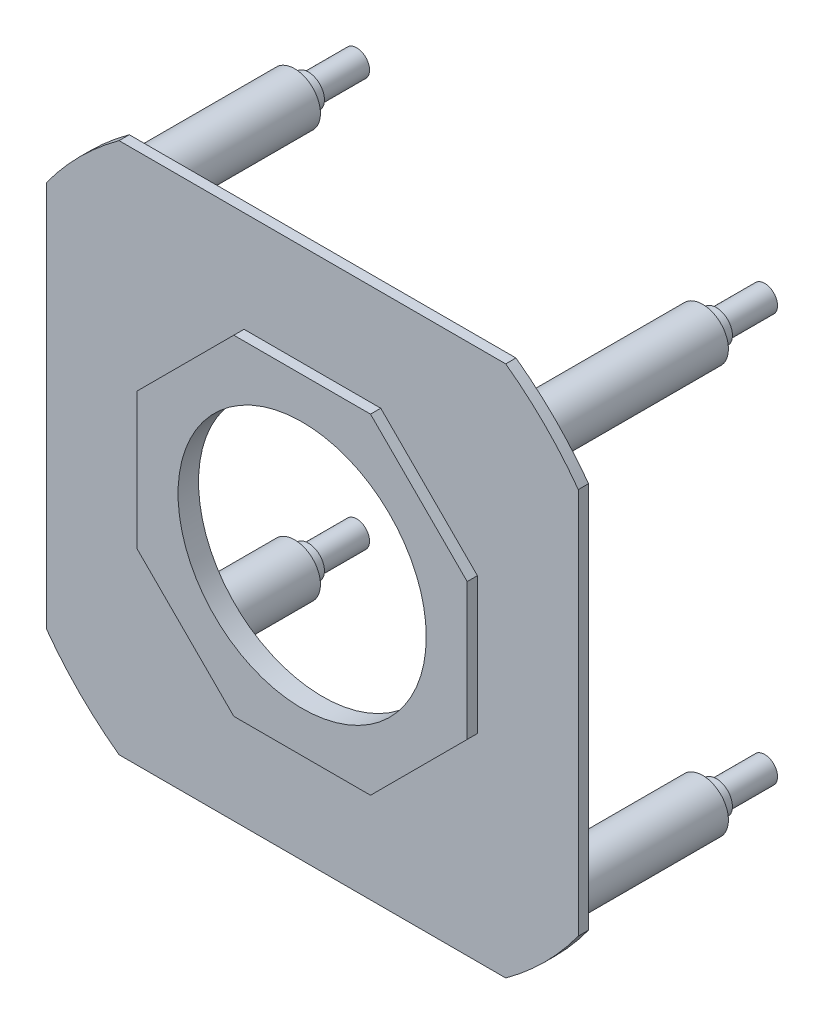
ISO-10303-21;
HEADER;
FILE_DESCRIPTION(('STEP AP214'),'2;1');
FILE_NAME('part.step','',(''),(''),'','','');
FILE_SCHEMA(('AUTOMOTIVE_DESIGN { 1 0 10303 214 1 1 1 1 }'));
ENDSEC;
DATA;
#1=APPLICATION_CONTEXT('core data for automotive mechanical design processes');
#2=APPLICATION_PROTOCOL_DEFINITION('international standard','automotive_design',2000,#1);
#3=PRODUCT_CONTEXT('',#1,'mechanical');
#4=PRODUCT('Part','Part','',(#3));
#5=PRODUCT_RELATED_PRODUCT_CATEGORY('part','',(#4));
#6=PRODUCT_DEFINITION_FORMATION('','',#4);
#7=PRODUCT_DEFINITION_CONTEXT('part definition',#1,'design');
#8=PRODUCT_DEFINITION('design','',#6,#7);
#9=PRODUCT_DEFINITION_SHAPE('','',#8);
#10=(LENGTH_UNIT() NAMED_UNIT(*) SI_UNIT(.MILLI.,.METRE.));
#11=(NAMED_UNIT(*) PLANE_ANGLE_UNIT() SI_UNIT($,.RADIAN.));
#12=(NAMED_UNIT(*) SI_UNIT($,.STERADIAN.) SOLID_ANGLE_UNIT());
#13=UNCERTAINTY_MEASURE_WITH_UNIT(LENGTH_MEASURE(1.E-05),#10,'distance_accuracy_value','');
#14=(GEOMETRIC_REPRESENTATION_CONTEXT(3) GLOBAL_UNCERTAINTY_ASSIGNED_CONTEXT((#13)) GLOBAL_UNIT_ASSIGNED_CONTEXT((#10,
#11,#12)) REPRESENTATION_CONTEXT('',''));
#15=CARTESIAN_POINT('',(0.,0.,0.));
#16=DIRECTION('',(0.,0.,1.));
#17=DIRECTION('',(1.,0.,0.));
#18=AXIS2_PLACEMENT_3D('',#15,#16,#17);
#19=CARTESIAN_POINT('',(0.,0.,3.175));
#20=DIRECTION('',(0.,0.,1.));
#21=DIRECTION('',(1.,0.,0.));
#22=AXIS2_PLACEMENT_3D('',#19,#20,#21);
#23=PLANE('',#22);
#24=DIRECTION('',(0.707106781186548,-0.707106781186547,0.));
#25=VECTOR('',#24,1.);
#26=CARTESIAN_POINT('',(36.2038671967512,36.2038671967513,3.175));
#27=LINE('',#26,#25);
#28=CARTESIAN_POINT('',(21.2077343935025,51.2,3.175));
#29=VERTEX_POINT('',#28);
#30=CARTESIAN_POINT('',(51.2,21.2077343935025,3.175));
#31=VERTEX_POINT('',#30);
#32=EDGE_CURVE('E346',#29,#31,#27,.T.);
#33=ORIENTED_EDGE('',*,*,#32,.T.);
#34=DIRECTION('',(0.,-1.,0.));
#35=VECTOR('',#34,1.);
#36=CARTESIAN_POINT('',(51.2,0.,3.175));
#37=LINE('',#36,#35);
#38=CARTESIAN_POINT('',(51.2,-21.2077343935025,3.175));
#39=VERTEX_POINT('',#38);
#40=EDGE_CURVE('E349',#31,#39,#37,.T.);
#41=ORIENTED_EDGE('',*,*,#40,.T.);
#42=DIRECTION('',(-0.707106781186547,-0.707106781186548,0.));
#43=VECTOR('',#42,1.);
#44=CARTESIAN_POINT('',(36.2038671967513,-36.2038671967512,3.175));
#45=LINE('',#44,#43);
#46=CARTESIAN_POINT('',(21.2077343935025,-51.2,3.175));
#47=VERTEX_POINT('',#46);
#48=EDGE_CURVE('E328',#39,#47,#45,.T.);
#49=ORIENTED_EDGE('',*,*,#48,.T.);
#50=DIRECTION('',(-1.,0.,0.));
#51=VECTOR('',#50,1.);
#52=CARTESIAN_POINT('',(0.,-51.2,3.175));
#53=LINE('',#52,#51);
#54=CARTESIAN_POINT('',(-21.2077343935024,-51.2,3.175));
#55=VERTEX_POINT('',#54);
#56=EDGE_CURVE('E331',#47,#55,#53,.T.);
#57=ORIENTED_EDGE('',*,*,#56,.T.);
#58=DIRECTION('',(-0.707106781186548,0.707106781186547,0.));
#59=VECTOR('',#58,1.);
#60=CARTESIAN_POINT('',(-36.2038671967512,-36.2038671967512,3.175));
#61=LINE('',#60,#59);
#62=CARTESIAN_POINT('',(-51.2,-21.2077343935025,3.175));
#63=VERTEX_POINT('',#62);
#64=EDGE_CURVE('E334',#55,#63,#61,.T.);
#65=ORIENTED_EDGE('',*,*,#64,.T.);
#66=DIRECTION('',(0.,1.,0.));
#67=VECTOR('',#66,1.);
#68=CARTESIAN_POINT('',(-51.2,0.,3.175));
#69=LINE('',#68,#67);
#70=CARTESIAN_POINT('',(-51.2,21.2077343935025,3.175));
#71=VERTEX_POINT('',#70);
#72=EDGE_CURVE('E337',#63,#71,#69,.T.);
#73=ORIENTED_EDGE('',*,*,#72,.T.);
#74=DIRECTION('',(0.707106781186547,0.707106781186548,0.));
#75=VECTOR('',#74,1.);
#76=CARTESIAN_POINT('',(-36.2038671967513,36.2038671967512,3.175));
#77=LINE('',#76,#75);
#78=CARTESIAN_POINT('',(-21.2077343935025,51.2,3.175));
#79=VERTEX_POINT('',#78);
#80=EDGE_CURVE('E340',#71,#79,#77,.T.);
#81=ORIENTED_EDGE('',*,*,#80,.T.);
#82=DIRECTION('',(1.,0.,0.));
#83=VECTOR('',#82,1.);
#84=CARTESIAN_POINT('',(0.,51.2,3.175));
#85=LINE('',#84,#83);
#86=EDGE_CURVE('E343',#79,#29,#85,.T.);
#87=ORIENTED_EDGE('',*,*,#86,.T.);
#88=EDGE_LOOP('',(#33,#41,#49,#57,#65,#73,#81,#87));
#89=FACE_BOUND('',#88,.T.);
#90=DIRECTION('',(0.,1.,0.));
#91=VECTOR('',#90,1.);
#92=CARTESIAN_POINT('',(82.5,0.,3.175));
#93=LINE('',#92,#91);
#94=CARTESIAN_POINT('',(82.5,-59.9812470693966,3.175));
#95=VERTEX_POINT('',#94);
#96=CARTESIAN_POINT('',(82.5,59.9812470693966,3.175));
#97=VERTEX_POINT('',#96);
#98=EDGE_CURVE('E221',#95,#97,#93,.T.);
#99=ORIENTED_EDGE('',*,*,#98,.T.);
#100=CARTESIAN_POINT('',(0.,0.,3.175));
#101=DIRECTION('',(0.,0.,1.));
#102=DIRECTION('',(1.,0.,0.));
#103=AXIS2_PLACEMENT_3D('',#100,#101,#102);
#104=CIRCLE('',#103,102.);
#105=CARTESIAN_POINT('',(59.9812470693966,82.5,3.175));
#106=VERTEX_POINT('',#105);
#107=EDGE_CURVE('E224',#97,#106,#104,.T.);
#108=ORIENTED_EDGE('',*,*,#107,.T.);
#109=DIRECTION('',(1.,0.,0.));
#110=VECTOR('',#109,1.);
#111=CARTESIAN_POINT('',(0.,82.5,3.175));
#112=LINE('',#111,#110);
#113=CARTESIAN_POINT('',(-59.9812470693966,82.5,3.175));
#114=VERTEX_POINT('',#113);
#115=EDGE_CURVE('E197',#114,#106,#112,.T.);
#116=ORIENTED_EDGE('',*,*,#115,.F.);
#117=CARTESIAN_POINT('',(0.,0.,3.175));
#118=DIRECTION('',(0.,0.,1.));
#119=DIRECTION('',(1.,0.,0.));
#120=AXIS2_PLACEMENT_3D('',#117,#118,#119);
#121=CIRCLE('',#120,102.);
#122=CARTESIAN_POINT('',(-82.5,59.9812470693966,3.175));
#123=VERTEX_POINT('',#122);
#124=EDGE_CURVE('E166',#114,#123,#121,.T.);
#125=ORIENTED_EDGE('',*,*,#124,.T.);
#126=DIRECTION('',(0.,1.,0.));
#127=VECTOR('',#126,1.);
#128=CARTESIAN_POINT('',(-82.5,0.,3.175));
#129=LINE('',#128,#127);
#130=CARTESIAN_POINT('',(-82.5,-59.9812470693966,3.175));
#131=VERTEX_POINT('',#130);
#132=EDGE_CURVE('E210',#131,#123,#129,.T.);
#133=ORIENTED_EDGE('',*,*,#132,.F.);
#134=CARTESIAN_POINT('',(0.,0.,3.175));
#135=DIRECTION('',(0.,0.,1.));
#136=DIRECTION('',(1.,0.,0.));
#137=AXIS2_PLACEMENT_3D('',#134,#135,#136);
#138=CIRCLE('',#137,102.);
#139=CARTESIAN_POINT('',(-59.9812470693966,-82.5,3.175));
#140=VERTEX_POINT('',#139);
#141=EDGE_CURVE('E212',#131,#140,#138,.T.);
#142=ORIENTED_EDGE('',*,*,#141,.T.);
#143=DIRECTION('',(1.,0.,0.));
#144=VECTOR('',#143,1.);
#145=CARTESIAN_POINT('',(0.,-82.5,3.175));
#146=LINE('',#145,#144);
#147=CARTESIAN_POINT('',(59.9812470693966,-82.5,3.175));
#148=VERTEX_POINT('',#147);
#149=EDGE_CURVE('E215',#140,#148,#146,.T.);
#150=ORIENTED_EDGE('',*,*,#149,.T.);
#151=CARTESIAN_POINT('',(0.,0.,3.175));
#152=DIRECTION('',(0.,0.,1.));
#153=DIRECTION('',(1.,0.,0.));
#154=AXIS2_PLACEMENT_3D('',#151,#152,#153);
#155=CIRCLE('',#154,102.);
#156=EDGE_CURVE('E218',#148,#95,#155,.T.);
#157=ORIENTED_EDGE('',*,*,#156,.T.);
#158=EDGE_LOOP('',(#99,#108,#116,#125,#133,#142,#150,#157));
#159=FACE_BOUND('',#158,.T.);
#160=ADVANCED_FACE('F45',(#89,#159),#23,.T.);
#161=CARTESIAN_POINT('',(0.,0.,0.));
#162=DIRECTION('',(0.,0.,1.));
#163=DIRECTION('',(1.,0.,0.));
#164=AXIS2_PLACEMENT_3D('',#161,#162,#163);
#165=PLANE('',#164);
#166=CARTESIAN_POINT('',(0.,0.,0.));
#167=DIRECTION('',(0.,0.,1.));
#168=DIRECTION('',(1.,0.,0.));
#169=AXIS2_PLACEMENT_3D('',#166,#167,#168);
#170=CIRCLE('',#169,38.5);
#171=CARTESIAN_POINT('',(38.5,0.,0.));
#172=VERTEX_POINT('',#171);
#173=EDGE_CURVE('E352',#172,#172,#170,.T.);
#174=ORIENTED_EDGE('',*,*,#173,.T.);
#175=EDGE_LOOP('',(#174));
#176=FACE_BOUND('',#175,.T.);
#177=CARTESIAN_POINT('',(63.2860569161959,63.2860569161961,0.));
#178=DIRECTION('',(0.,0.,1.));
#179=DIRECTION('',(1.,0.,0.));
#180=AXIS2_PLACEMENT_3D('',#177,#178,#179);
#181=CIRCLE('',#180,8.);
#182=CARTESIAN_POINT('',(71.2860569161959,63.2860569161961,0.));
#183=VERTEX_POINT('',#182);
#184=EDGE_CURVE('E279',#183,#183,#181,.F.);
#185=ORIENTED_EDGE('',*,*,#184,.F.);
#186=EDGE_LOOP('',(#185));
#187=FACE_BOUND('',#186,.T.);
#188=CARTESIAN_POINT('',(-63.2860569170105,63.2860569164639,0.));
#189=DIRECTION('',(0.,0.,1.));
#190=DIRECTION('',(1.,0.,0.));
#191=AXIS2_PLACEMENT_3D('',#188,#189,#190);
#192=CIRCLE('',#191,8.);
#193=CARTESIAN_POINT('',(-55.2860569170105,63.2860569164639,0.));
#194=VERTEX_POINT('',#193);
#195=EDGE_CURVE('E275',#194,#194,#192,.F.);
#196=ORIENTED_EDGE('',*,*,#195,.F.);
#197=EDGE_LOOP('',(#196));
#198=FACE_BOUND('',#197,.T.);
#199=CARTESIAN_POINT('',(-63.2860569170206,-63.2860569164763,0.));
#200=DIRECTION('',(0.,0.,1.));
#201=DIRECTION('',(1.,0.,0.));
#202=AXIS2_PLACEMENT_3D('',#199,#200,#201);
#203=CIRCLE('',#202,8.);
#204=CARTESIAN_POINT('',(-55.2860569170206,-63.2860569164763,0.));
#205=VERTEX_POINT('',#204);
#206=EDGE_CURVE('E358',#205,#205,#203,.F.);
#207=ORIENTED_EDGE('',*,*,#206,.F.);
#208=EDGE_LOOP('',(#207));
#209=FACE_BOUND('',#208,.T.);
#210=CARTESIAN_POINT('',(63.2860569159197,-63.2860569164663,0.));
#211=DIRECTION('',(0.,0.,1.));
#212=DIRECTION('',(1.,0.,0.));
#213=AXIS2_PLACEMENT_3D('',#210,#211,#212);
#214=CIRCLE('',#213,8.);
#215=CARTESIAN_POINT('',(71.2860569159197,-63.2860569164663,0.));
#216=VERTEX_POINT('',#215);
#217=EDGE_CURVE('E49',#216,#216,#214,.F.);
#218=ORIENTED_EDGE('',*,*,#217,.F.);
#219=EDGE_LOOP('',(#218));
#220=FACE_BOUND('',#219,.T.);
#221=CARTESIAN_POINT('',(0.,0.,0.));
#222=DIRECTION('',(0.,0.,-1.));
#223=DIRECTION('',(-1.,0.,0.));
#224=AXIS2_PLACEMENT_3D('',#221,#222,#223);
#225=CIRCLE('',#224,102.);
#226=CARTESIAN_POINT('',(59.9812470693966,82.5,0.));
#227=VERTEX_POINT('',#226);
#228=CARTESIAN_POINT('',(82.5,59.9812470693966,0.));
#229=VERTEX_POINT('',#228);
#230=EDGE_CURVE('E70',#227,#229,#225,.T.);
#231=ORIENTED_EDGE('',*,*,#230,.T.);
#232=DIRECTION('',(0.,-1.,0.));
#233=VECTOR('',#232,1.);
#234=CARTESIAN_POINT('',(82.5,0.,0.));
#235=LINE('',#234,#233);
#236=CARTESIAN_POINT('',(82.5,-59.9812470693966,0.));
#237=VERTEX_POINT('',#236);
#238=EDGE_CURVE('E192',#229,#237,#235,.T.);
#239=ORIENTED_EDGE('',*,*,#238,.T.);
#240=CARTESIAN_POINT('',(0.,0.,0.));
#241=DIRECTION('',(0.,0.,-1.));
#242=DIRECTION('',(-1.,0.,0.));
#243=AXIS2_PLACEMENT_3D('',#240,#241,#242);
#244=CIRCLE('',#243,102.);
#245=CARTESIAN_POINT('',(59.9812470693966,-82.5,0.));
#246=VERTEX_POINT('',#245);
#247=EDGE_CURVE('E189',#237,#246,#244,.T.);
#248=ORIENTED_EDGE('',*,*,#247,.T.);
#249=DIRECTION('',(-1.,0.,0.));
#250=VECTOR('',#249,1.);
#251=CARTESIAN_POINT('',(0.,-82.5,0.));
#252=LINE('',#251,#250);
#253=CARTESIAN_POINT('',(-59.9812470693966,-82.5,0.));
#254=VERTEX_POINT('',#253);
#255=EDGE_CURVE('E186',#246,#254,#252,.T.);
#256=ORIENTED_EDGE('',*,*,#255,.T.);
#257=CARTESIAN_POINT('',(0.,0.,0.));
#258=DIRECTION('',(0.,0.,-1.));
#259=DIRECTION('',(-1.,0.,0.));
#260=AXIS2_PLACEMENT_3D('',#257,#258,#259);
#261=CIRCLE('',#260,102.);
#262=CARTESIAN_POINT('',(-82.5,-59.9812470693966,0.));
#263=VERTEX_POINT('',#262);
#264=EDGE_CURVE('E181',#254,#263,#261,.T.);
#265=ORIENTED_EDGE('',*,*,#264,.T.);
#266=DIRECTION('',(0.,-1.,0.));
#267=VECTOR('',#266,1.);
#268=CARTESIAN_POINT('',(-82.5,0.,0.));
#269=LINE('',#268,#267);
#270=CARTESIAN_POINT('',(-82.5,59.9812470693966,0.));
#271=VERTEX_POINT('',#270);
#272=EDGE_CURVE('E179',#271,#263,#269,.T.);
#273=ORIENTED_EDGE('',*,*,#272,.F.);
#274=CARTESIAN_POINT('',(0.,0.,0.));
#275=DIRECTION('',(0.,0.,-1.));
#276=DIRECTION('',(-1.,0.,0.));
#277=AXIS2_PLACEMENT_3D('',#274,#275,#276);
#278=CIRCLE('',#277,102.);
#279=CARTESIAN_POINT('',(-59.9812470693966,82.5,0.));
#280=VERTEX_POINT('',#279);
#281=EDGE_CURVE('E163',#271,#280,#278,.T.);
#282=ORIENTED_EDGE('',*,*,#281,.T.);
#283=DIRECTION('',(-1.,0.,0.));
#284=VECTOR('',#283,1.);
#285=CARTESIAN_POINT('',(0.,82.5,0.));
#286=LINE('',#285,#284);
#287=EDGE_CURVE('E172',#227,#280,#286,.T.);
#288=ORIENTED_EDGE('',*,*,#287,.F.);
#289=EDGE_LOOP('',(#231,#239,#248,#256,#265,#273,#282,#288));
#290=FACE_BOUND('',#289,.T.);
#291=ADVANCED_FACE('F176',(#176,#187,#198,#209,#220,#290),#165,.F.);
#292=CARTESIAN_POINT('',(0.,0.,3.175));
#293=DIRECTION('',(0.,0.,-1.));
#294=DIRECTION('',(-1.,0.,0.));
#295=AXIS2_PLACEMENT_3D('',#292,#293,#294);
#296=CYLINDRICAL_SURFACE('',#295,38.5);
#297=ORIENTED_EDGE('',*,*,#173,.F.);
#298=EDGE_LOOP('',(#297));
#299=FACE_BOUND('',#298,.T.);
#300=CARTESIAN_POINT('',(0.,0.,6.35));
#301=DIRECTION('',(0.,0.,1.));
#302=DIRECTION('',(1.,0.,0.));
#303=AXIS2_PLACEMENT_3D('',#300,#301,#302);
#304=CIRCLE('',#303,38.5);
#305=CARTESIAN_POINT('',(38.5,0.,6.35));
#306=VERTEX_POINT('',#305);
#307=EDGE_CURVE('E285',#306,#306,#304,.T.);
#308=ORIENTED_EDGE('',*,*,#307,.T.);
#309=EDGE_LOOP('',(#308));
#310=FACE_BOUND('',#309,.T.);
#311=ADVANCED_FACE('F47',(#299,#310),#296,.F.);
#312=CARTESIAN_POINT('',(51.2,0.,6.35));
#313=DIRECTION('',(-1.,0.,0.));
#314=DIRECTION('',(0.,0.,1.));
#315=AXIS2_PLACEMENT_3D('',#312,#313,#314);
#316=PLANE('',#315);
#317=ORIENTED_EDGE('',*,*,#40,.F.);
#318=DIRECTION('',(0.,0.,-1.));
#319=VECTOR('',#318,1.);
#320=CARTESIAN_POINT('',(51.2,21.2077343935025,6.35));
#321=LINE('',#320,#319);
#322=CARTESIAN_POINT('',(51.2,21.2077343935025,6.35));
#323=VERTEX_POINT('',#322);
#324=EDGE_CURVE('E325',#323,#31,#321,.T.);
#325=ORIENTED_EDGE('',*,*,#324,.F.);
#326=DIRECTION('',(0.,1.,0.));
#327=VECTOR('',#326,1.);
#328=CARTESIAN_POINT('',(51.2,0.,6.35));
#329=LINE('',#328,#327);
#330=CARTESIAN_POINT('',(51.2,-21.2077343935025,6.35));
#331=VERTEX_POINT('',#330);
#332=EDGE_CURVE('E288',#331,#323,#329,.T.);
#333=ORIENTED_EDGE('',*,*,#332,.F.);
#334=DIRECTION('',(0.,0.,-1.));
#335=VECTOR('',#334,1.);
#336=CARTESIAN_POINT('',(51.2,-21.2077343935025,6.35));
#337=LINE('',#336,#335);
#338=EDGE_CURVE('E305',#331,#39,#337,.T.);
#339=ORIENTED_EDGE('',*,*,#338,.T.);
#340=EDGE_LOOP('',(#317,#325,#333,#339));
#341=FACE_BOUND('',#340,.T.);
#342=ADVANCED_FACE('F375',(#341),#316,.F.);
#343=CARTESIAN_POINT('',(36.2038671967513,36.2038671967513,6.35));
#344=DIRECTION('',(-0.707106781186547,-0.707106781186548,0.));
#345=DIRECTION('',(0.707106781186548,-0.707106781186547,0.));
#346=AXIS2_PLACEMENT_3D('',#343,#344,#345);
#347=PLANE('',#346);
#348=ORIENTED_EDGE('',*,*,#32,.F.);
#349=DIRECTION('',(0.,0.,-1.));
#350=VECTOR('',#349,1.);
#351=CARTESIAN_POINT('',(21.2077343935025,51.2,6.35));
#352=LINE('',#351,#350);
#353=CARTESIAN_POINT('',(21.2077343935025,51.2,6.35));
#354=VERTEX_POINT('',#353);
#355=EDGE_CURVE('E322',#354,#29,#352,.T.);
#356=ORIENTED_EDGE('',*,*,#355,.F.);
#357=DIRECTION('',(-0.707106781186548,0.707106781186547,0.));
#358=VECTOR('',#357,1.);
#359=CARTESIAN_POINT('',(36.2038671967513,36.2038671967513,6.35));
#360=LINE('',#359,#358);
#361=EDGE_CURVE('E291',#323,#354,#360,.T.);
#362=ORIENTED_EDGE('',*,*,#361,.F.);
#363=ORIENTED_EDGE('',*,*,#324,.T.);
#364=EDGE_LOOP('',(#348,#356,#362,#363));
#365=FACE_BOUND('',#364,.T.);
#366=ADVANCED_FACE('F383',(#365),#347,.F.);
#367=CARTESIAN_POINT('',(0.,51.2,6.35));
#368=DIRECTION('',(0.,-1.,0.));
#369=DIRECTION('',(1.,0.,0.));
#370=AXIS2_PLACEMENT_3D('',#367,#368,#369);
#371=PLANE('',#370);
#372=ORIENTED_EDGE('',*,*,#86,.F.);
#373=DIRECTION('',(0.,0.,-1.));
#374=VECTOR('',#373,1.);
#375=CARTESIAN_POINT('',(-21.2077343935025,51.2,6.35));
#376=LINE('',#375,#374);
#377=CARTESIAN_POINT('',(-21.2077343935025,51.2,6.35));
#378=VERTEX_POINT('',#377);
#379=EDGE_CURVE('E319',#378,#79,#376,.T.);
#380=ORIENTED_EDGE('',*,*,#379,.F.);
#381=DIRECTION('',(-1.,0.,0.));
#382=VECTOR('',#381,1.);
#383=CARTESIAN_POINT('',(0.,51.2,6.35));
#384=LINE('',#383,#382);
#385=EDGE_CURVE('E293',#354,#378,#384,.T.);
#386=ORIENTED_EDGE('',*,*,#385,.F.);
#387=ORIENTED_EDGE('',*,*,#355,.T.);
#388=EDGE_LOOP('',(#372,#380,#386,#387));
#389=FACE_BOUND('',#388,.T.);
#390=ADVANCED_FACE('F387',(#389),#371,.F.);
#391=CARTESIAN_POINT('',(-36.2038671967512,36.2038671967512,6.35));
#392=DIRECTION('',(0.707106781186548,-0.707106781186547,0.));
#393=DIRECTION('',(0.707106781186547,0.707106781186548,0.));
#394=AXIS2_PLACEMENT_3D('',#391,#392,#393);
#395=PLANE('',#394);
#396=ORIENTED_EDGE('',*,*,#80,.F.);
#397=DIRECTION('',(0.,0.,-1.));
#398=VECTOR('',#397,1.);
#399=CARTESIAN_POINT('',(-51.2,21.2077343935025,6.35));
#400=LINE('',#399,#398);
#401=CARTESIAN_POINT('',(-51.2,21.2077343935025,6.35));
#402=VERTEX_POINT('',#401);
#403=EDGE_CURVE('E316',#402,#71,#400,.T.);
#404=ORIENTED_EDGE('',*,*,#403,.F.);
#405=DIRECTION('',(-0.707106781186547,-0.707106781186548,0.));
#406=VECTOR('',#405,1.);
#407=CARTESIAN_POINT('',(-36.2038671967512,36.2038671967512,6.35));
#408=LINE('',#407,#406);
#409=EDGE_CURVE('E295',#378,#402,#408,.T.);
#410=ORIENTED_EDGE('',*,*,#409,.F.);
#411=ORIENTED_EDGE('',*,*,#379,.T.);
#412=EDGE_LOOP('',(#396,#404,#410,#411));
#413=FACE_BOUND('',#412,.T.);
#414=ADVANCED_FACE('F391',(#413),#395,.F.);
#415=CARTESIAN_POINT('',(-51.2,0.,6.35));
#416=DIRECTION('',(1.,0.,0.));
#417=DIRECTION('',(0.,1.,0.));
#418=AXIS2_PLACEMENT_3D('',#415,#416,#417);
#419=PLANE('',#418);
#420=ORIENTED_EDGE('',*,*,#72,.F.);
#421=DIRECTION('',(0.,0.,-1.));
#422=VECTOR('',#421,1.);
#423=CARTESIAN_POINT('',(-51.2,-21.2077343935025,6.35));
#424=LINE('',#423,#422);
#425=CARTESIAN_POINT('',(-51.2,-21.2077343935025,6.35));
#426=VERTEX_POINT('',#425);
#427=EDGE_CURVE('E313',#426,#63,#424,.T.);
#428=ORIENTED_EDGE('',*,*,#427,.F.);
#429=DIRECTION('',(0.,-1.,0.));
#430=VECTOR('',#429,1.);
#431=CARTESIAN_POINT('',(-51.2,0.,6.35));
#432=LINE('',#431,#430);
#433=EDGE_CURVE('E297',#402,#426,#432,.T.);
#434=ORIENTED_EDGE('',*,*,#433,.F.);
#435=ORIENTED_EDGE('',*,*,#403,.T.);
#436=EDGE_LOOP('',(#420,#428,#434,#435));
#437=FACE_BOUND('',#436,.T.);
#438=ADVANCED_FACE('F395',(#437),#419,.F.);
#439=CARTESIAN_POINT('',(-36.2038671967512,-36.2038671967512,6.35));
#440=DIRECTION('',(0.707106781186547,0.707106781186548,0.));
#441=DIRECTION('',(-0.707106781186548,0.707106781186547,0.));
#442=AXIS2_PLACEMENT_3D('',#439,#440,#441);
#443=PLANE('',#442);
#444=ORIENTED_EDGE('',*,*,#64,.F.);
#445=DIRECTION('',(0.,0.,-1.));
#446=VECTOR('',#445,1.);
#447=CARTESIAN_POINT('',(-21.2077343935024,-51.2,6.35));
#448=LINE('',#447,#446);
#449=CARTESIAN_POINT('',(-21.2077343935024,-51.2,6.35));
#450=VERTEX_POINT('',#449);
#451=EDGE_CURVE('E310',#450,#55,#448,.T.);
#452=ORIENTED_EDGE('',*,*,#451,.F.);
#453=DIRECTION('',(0.707106781186548,-0.707106781186547,0.));
#454=VECTOR('',#453,1.);
#455=CARTESIAN_POINT('',(-36.2038671967512,-36.2038671967512,6.35));
#456=LINE('',#455,#454);
#457=EDGE_CURVE('E299',#426,#450,#456,.T.);
#458=ORIENTED_EDGE('',*,*,#457,.F.);
#459=ORIENTED_EDGE('',*,*,#427,.T.);
#460=EDGE_LOOP('',(#444,#452,#458,#459));
#461=FACE_BOUND('',#460,.T.);
#462=ADVANCED_FACE('F399',(#461),#443,.F.);
#463=CARTESIAN_POINT('',(0.,-51.2,6.35));
#464=DIRECTION('',(0.,1.,0.));
#465=DIRECTION('',(-1.,0.,0.));
#466=AXIS2_PLACEMENT_3D('',#463,#464,#465);
#467=PLANE('',#466);
#468=ORIENTED_EDGE('',*,*,#56,.F.);
#469=DIRECTION('',(0.,0.,-1.));
#470=VECTOR('',#469,1.);
#471=CARTESIAN_POINT('',(21.2077343935025,-51.2,6.35));
#472=LINE('',#471,#470);
#473=CARTESIAN_POINT('',(21.2077343935025,-51.2,6.35));
#474=VERTEX_POINT('',#473);
#475=EDGE_CURVE('E308',#474,#47,#472,.T.);
#476=ORIENTED_EDGE('',*,*,#475,.F.);
#477=DIRECTION('',(1.,0.,0.));
#478=VECTOR('',#477,1.);
#479=CARTESIAN_POINT('',(0.,-51.2,6.35));
#480=LINE('',#479,#478);
#481=EDGE_CURVE('E301',#450,#474,#480,.T.);
#482=ORIENTED_EDGE('',*,*,#481,.F.);
#483=ORIENTED_EDGE('',*,*,#451,.T.);
#484=EDGE_LOOP('',(#468,#476,#482,#483));
#485=FACE_BOUND('',#484,.T.);
#486=ADVANCED_FACE('F403',(#485),#467,.F.);
#487=CARTESIAN_POINT('',(36.2038671967513,-36.2038671967513,6.35));
#488=DIRECTION('',(-0.707106781186548,0.707106781186547,0.));
#489=DIRECTION('',(-0.707106781186547,-0.707106781186548,0.));
#490=AXIS2_PLACEMENT_3D('',#487,#488,#489);
#491=PLANE('',#490);
#492=ORIENTED_EDGE('',*,*,#48,.F.);
#493=ORIENTED_EDGE('',*,*,#338,.F.);
#494=DIRECTION('',(0.707106781186547,0.707106781186548,0.));
#495=VECTOR('',#494,1.);
#496=CARTESIAN_POINT('',(36.2038671967513,-36.2038671967513,6.35));
#497=LINE('',#496,#495);
#498=EDGE_CURVE('E303',#474,#331,#497,.T.);
#499=ORIENTED_EDGE('',*,*,#498,.F.);
#500=ORIENTED_EDGE('',*,*,#475,.T.);
#501=EDGE_LOOP('',(#492,#493,#499,#500));
#502=FACE_BOUND('',#501,.T.);
#503=ADVANCED_FACE('F407',(#502),#491,.F.);
#504=CARTESIAN_POINT('',(0.,0.,6.35));
#505=DIRECTION('',(0.,0.,1.));
#506=DIRECTION('',(1.,0.,0.));
#507=AXIS2_PLACEMENT_3D('',#504,#505,#506);
#508=PLANE('',#507);
#509=ORIENTED_EDGE('',*,*,#307,.F.);
#510=EDGE_LOOP('',(#509));
#511=FACE_BOUND('',#510,.T.);
#512=ORIENTED_EDGE('',*,*,#332,.T.);
#513=ORIENTED_EDGE('',*,*,#361,.T.);
#514=ORIENTED_EDGE('',*,*,#385,.T.);
#515=ORIENTED_EDGE('',*,*,#409,.T.);
#516=ORIENTED_EDGE('',*,*,#433,.T.);
#517=ORIENTED_EDGE('',*,*,#457,.T.);
#518=ORIENTED_EDGE('',*,*,#481,.T.);
#519=ORIENTED_EDGE('',*,*,#498,.T.);
#520=EDGE_LOOP('',(#512,#513,#514,#515,#516,#517,#518,#519));
#521=FACE_BOUND('',#520,.T.);
#522=ADVANCED_FACE('F411',(#511,#521),#508,.T.);
#523=CARTESIAN_POINT('',(63.2860569161959,63.2860569161961,-79.2309719776903));
#524=DIRECTION('',(0.,0.,1.));
#525=DIRECTION('',(1.,0.,0.));
#526=AXIS2_PLACEMENT_3D('',#523,#524,#525);
#527=CYLINDRICAL_SURFACE('',#526,8.);
#528=ORIENTED_EDGE('',*,*,#184,.T.);
#529=EDGE_LOOP('',(#528));
#530=FACE_BOUND('',#529,.T.);
#531=CARTESIAN_POINT('',(63.2860569161959,63.2860569161961,-54.6035549797208));
#532=DIRECTION('',(0.,0.,-1.));
#533=DIRECTION('',(-1.,0.,0.));
#534=AXIS2_PLACEMENT_3D('',#531,#532,#533);
#535=CIRCLE('',#534,8.);
#536=CARTESIAN_POINT('',(55.2860569161959,63.2860569161961,-54.6035549797208));
#537=VERTEX_POINT('',#536);
#538=EDGE_CURVE('E282',#537,#537,#535,.T.);
#539=ORIENTED_EDGE('',*,*,#538,.F.);
#540=EDGE_LOOP('',(#539));
#541=FACE_BOUND('',#540,.T.);
#542=ADVANCED_FACE('F415',(#530,#541),#527,.T.);
#543=CARTESIAN_POINT('',(72.6024062828825,60.9558455189923,-54.6035549797208));
#544=DIRECTION('',(0.,0.,-1.));
#545=DIRECTION('',(-0.947303208345662,0.320338307821616,0.));
#546=AXIS2_PLACEMENT_3D('',#543,#544,#545);
#547=PLANE('',#546);
#548=CARTESIAN_POINT('',(63.2860569161959,63.2860569161961,-54.6035549797209));
#549=DIRECTION('',(0.,0.,-1.));
#550=DIRECTION('',(-1.,0.,0.));
#551=AXIS2_PLACEMENT_3D('',#548,#549,#550);
#552=CIRCLE('',#551,4.99999999999999);
#553=CARTESIAN_POINT('',(58.2860569161959,63.2860569161961,-54.6035549797209));
#554=VERTEX_POINT('',#553);
#555=EDGE_CURVE('E276',#554,#554,#552,.T.);
#556=ORIENTED_EDGE('',*,*,#555,.F.);
#557=EDGE_LOOP('',(#556));
#558=FACE_BOUND('',#557,.T.);
#559=ORIENTED_EDGE('',*,*,#538,.T.);
#560=EDGE_LOOP('',(#559));
#561=FACE_BOUND('',#560,.T.);
#562=ADVANCED_FACE('F417',(#558,#561),#547,.T.);
#563=CARTESIAN_POINT('',(63.2860569161959,63.2860569161961,-72.9956906034517));
#564=DIRECTION('',(0.,0.,1.));
#565=DIRECTION('',(1.,0.,0.));
#566=AXIS2_PLACEMENT_3D('',#563,#564,#565);
#567=CYLINDRICAL_SURFACE('',#566,4.99999999999999);
#568=ORIENTED_EDGE('',*,*,#555,.T.);
#569=EDGE_LOOP('',(#568));
#570=FACE_BOUND('',#569,.T.);
#571=CARTESIAN_POINT('',(63.2860569161959,63.2860569161961,-58.8535549797208));
#572=DIRECTION('',(0.,0.,-1.));
#573=DIRECTION('',(-1.,0.,0.));
#574=AXIS2_PLACEMENT_3D('',#571,#572,#573);
#575=CIRCLE('',#574,4.99999999999999);
#576=CARTESIAN_POINT('',(58.2860569161959,63.2860569161961,-58.8535549797208));
#577=VERTEX_POINT('',#576);
#578=EDGE_CURVE('E271',#577,#577,#575,.T.);
#579=ORIENTED_EDGE('',*,*,#578,.F.);
#580=EDGE_LOOP('',(#579));
#581=FACE_BOUND('',#580,.T.);
#582=ADVANCED_FACE('F420',(#570,#581),#567,.T.);
#583=CARTESIAN_POINT('',(63.2860569161959,63.2860569161961,-58.8535549797208));
#584=DIRECTION('',(0.,0.,-1.));
#585=DIRECTION('',(-0.998024909179756,-0.0628194289749621,0.));
#586=AXIS2_PLACEMENT_3D('',#583,#584,#585);
#587=PLANE('',#586);
#588=CARTESIAN_POINT('',(63.2860569161959,63.2860569161961,-58.8535549797208));
#589=DIRECTION('',(0.,0.,-1.));
#590=DIRECTION('',(-1.,0.,0.));
#591=AXIS2_PLACEMENT_3D('',#588,#589,#590);
#592=CIRCLE('',#591,4.00000000000001);
#593=CARTESIAN_POINT('',(59.2860569161959,63.2860569161961,-58.8535549797208));
#594=VERTEX_POINT('',#593);
#595=EDGE_CURVE('E272',#594,#594,#592,.T.);
#596=ORIENTED_EDGE('',*,*,#595,.F.);
#597=EDGE_LOOP('',(#596));
#598=FACE_BOUND('',#597,.T.);
#599=ORIENTED_EDGE('',*,*,#578,.T.);
#600=EDGE_LOOP('',(#599));
#601=FACE_BOUND('',#600,.T.);
#602=ADVANCED_FACE('F425',(#598,#601),#587,.T.);
#603=CARTESIAN_POINT('',(63.2860569161959,63.2860569161961,-73.8535549797208));
#604=DIRECTION('',(0.,0.,1.));
#605=DIRECTION('',(1.,0.,0.));
#606=AXIS2_PLACEMENT_3D('',#603,#604,#605);
#607=CYLINDRICAL_SURFACE('',#606,4.00000000000001);
#608=CARTESIAN_POINT('',(63.2860569161959,63.2860569161961,-73.8535549797208));
#609=DIRECTION('',(0.,0.,-1.));
#610=DIRECTION('',(-1.,0.,0.));
#611=AXIS2_PLACEMENT_3D('',#608,#609,#610);
#612=CIRCLE('',#611,4.00000000000001);
#613=CARTESIAN_POINT('',(59.2860569161959,63.2860569161961,-73.8535549797208));
#614=VERTEX_POINT('',#613);
#615=EDGE_CURVE('E268',#614,#614,#612,.T.);
#616=ORIENTED_EDGE('',*,*,#615,.F.);
#617=EDGE_LOOP('',(#616));
#618=FACE_BOUND('',#617,.T.);
#619=ORIENTED_EDGE('',*,*,#595,.T.);
#620=EDGE_LOOP('',(#619));
#621=FACE_BOUND('',#620,.T.);
#622=ADVANCED_FACE('F428',(#618,#621),#607,.T.);
#623=CARTESIAN_POINT('',(63.2860569161959,63.2860569161961,-73.8535549797208));
#624=DIRECTION('',(0.,0.,-1.));
#625=DIRECTION('',(-1.,0.,0.));
#626=AXIS2_PLACEMENT_3D('',#623,#624,#625);
#627=PLANE('',#626);
#628=ORIENTED_EDGE('',*,*,#615,.T.);
#629=EDGE_LOOP('',(#628));
#630=FACE_BOUND('',#629,.T.);
#631=ADVANCED_FACE('F435',(#630),#627,.T.);
#632=CARTESIAN_POINT('',(-63.2860569170105,63.2860569164639,-79.2309719776904));
#633=DIRECTION('',(0.,0.,1.));
#634=DIRECTION('',(1.,0.,0.));
#635=AXIS2_PLACEMENT_3D('',#632,#633,#634);
#636=CYLINDRICAL_SURFACE('',#635,8.);
#637=ORIENTED_EDGE('',*,*,#195,.T.);
#638=EDGE_LOOP('',(#637));
#639=FACE_BOUND('',#638,.T.);
#640=CARTESIAN_POINT('',(-63.2860569170105,63.2860569164639,-54.6035549797209));
#641=DIRECTION('',(0.,0.,-1.));
#642=DIRECTION('',(-1.,0.,0.));
#643=AXIS2_PLACEMENT_3D('',#640,#641,#642);
#644=CIRCLE('',#643,8.);
#645=CARTESIAN_POINT('',(-71.2860569170105,63.2860569164639,-54.6035549797209));
#646=VERTEX_POINT('',#645);
#647=EDGE_CURVE('E265',#646,#646,#644,.T.);
#648=ORIENTED_EDGE('',*,*,#647,.F.);
#649=EDGE_LOOP('',(#648));
#650=FACE_BOUND('',#649,.T.);
#651=ADVANCED_FACE('F439',(#639,#650),#636,.T.);
#652=CARTESIAN_POINT('',(72.6024062828825,60.9558455189923,-54.6035549797208));
#653=DIRECTION('',(0.,0.,-1.));
#654=DIRECTION('',(-0.947303208345662,0.320338307821616,0.));
#655=AXIS2_PLACEMENT_3D('',#652,#653,#654);
#656=PLANE('',#655);
#657=CARTESIAN_POINT('',(-63.2860569170105,63.286056916464,-54.6035549797209));
#658=DIRECTION('',(0.,0.,-1.));
#659=DIRECTION('',(-1.,0.,0.));
#660=AXIS2_PLACEMENT_3D('',#657,#658,#659);
#661=CIRCLE('',#660,4.99999999999999);
#662=CARTESIAN_POINT('',(-68.2860569170105,63.286056916464,-54.6035549797209));
#663=VERTEX_POINT('',#662);
#664=EDGE_CURVE('E251',#663,#663,#661,.T.);
#665=ORIENTED_EDGE('',*,*,#664,.F.);
#666=EDGE_LOOP('',(#665));
#667=FACE_BOUND('',#666,.T.);
#668=ORIENTED_EDGE('',*,*,#647,.T.);
#669=EDGE_LOOP('',(#668));
#670=FACE_BOUND('',#669,.T.);
#671=ADVANCED_FACE('F441',(#667,#670),#656,.T.);
#672=CARTESIAN_POINT('',(-63.2860569170206,-63.2860569164763,-79.2309719776904));
#673=DIRECTION('',(0.,0.,1.));
#674=DIRECTION('',(1.,0.,0.));
#675=AXIS2_PLACEMENT_3D('',#672,#673,#674);
#676=CYLINDRICAL_SURFACE('',#675,8.);
#677=ORIENTED_EDGE('',*,*,#206,.T.);
#678=EDGE_LOOP('',(#677));
#679=FACE_BOUND('',#678,.T.);
#680=CARTESIAN_POINT('',(-63.2860569170206,-63.2860569164763,-54.6035549797209));
#681=DIRECTION('',(0.,0.,-1.));
#682=DIRECTION('',(-1.,0.,0.));
#683=AXIS2_PLACEMENT_3D('',#680,#681,#682);
#684=CIRCLE('',#683,8.);
#685=CARTESIAN_POINT('',(-71.2860569170206,-63.2860569164763,-54.6035549797209));
#686=VERTEX_POINT('',#685);
#687=EDGE_CURVE('E262',#686,#686,#684,.T.);
#688=ORIENTED_EDGE('',*,*,#687,.F.);
#689=EDGE_LOOP('',(#688));
#690=FACE_BOUND('',#689,.T.);
#691=ADVANCED_FACE('F444',(#679,#690),#676,.T.);
#692=CARTESIAN_POINT('',(72.6024062828825,60.9558455189923,-54.6035549797208));
#693=DIRECTION('',(0.,0.,-1.));
#694=DIRECTION('',(-0.947303208345662,0.320338307821616,0.));
#695=AXIS2_PLACEMENT_3D('',#692,#693,#694);
#696=PLANE('',#695);
#697=CARTESIAN_POINT('',(-63.2860569170205,-63.2860569164763,-54.6035549797209));
#698=DIRECTION('',(0.,0.,-1.));
#699=DIRECTION('',(-1.,0.,0.));
#700=AXIS2_PLACEMENT_3D('',#697,#698,#699);
#701=CIRCLE('',#700,4.99999999999999);
#702=CARTESIAN_POINT('',(-68.2860569170205,-63.2860569164763,-54.6035549797209));
#703=VERTEX_POINT('',#702);
#704=EDGE_CURVE('E245',#703,#703,#701,.T.);
#705=ORIENTED_EDGE('',*,*,#704,.F.);
#706=EDGE_LOOP('',(#705));
#707=FACE_BOUND('',#706,.T.);
#708=ORIENTED_EDGE('',*,*,#687,.T.);
#709=EDGE_LOOP('',(#708));
#710=FACE_BOUND('',#709,.T.);
#711=ADVANCED_FACE('F449',(#707,#710),#696,.T.);
#712=CARTESIAN_POINT('',(63.2860569159197,-63.2860569164663,-79.2309719776904));
#713=DIRECTION('',(0.,0.,1.));
#714=DIRECTION('',(1.,0.,0.));
#715=AXIS2_PLACEMENT_3D('',#712,#713,#714);
#716=CYLINDRICAL_SURFACE('',#715,8.);
#717=ORIENTED_EDGE('',*,*,#217,.T.);
#718=EDGE_LOOP('',(#717));
#719=FACE_BOUND('',#718,.T.);
#720=CARTESIAN_POINT('',(63.2860569159197,-63.2860569164663,-54.6035549797208));
#721=DIRECTION('',(0.,0.,-1.));
#722=DIRECTION('',(-1.,0.,0.));
#723=AXIS2_PLACEMENT_3D('',#720,#721,#722);
#724=CIRCLE('',#723,8.);
#725=CARTESIAN_POINT('',(55.2860569159197,-63.2860569164663,-54.6035549797208));
#726=VERTEX_POINT('',#725);
#727=EDGE_CURVE('E259',#726,#726,#724,.T.);
#728=ORIENTED_EDGE('',*,*,#727,.F.);
#729=EDGE_LOOP('',(#728));
#730=FACE_BOUND('',#729,.T.);
#731=ADVANCED_FACE('F365',(#719,#730),#716,.T.);
#732=CARTESIAN_POINT('',(72.6024062828825,60.9558455189923,-54.6035549797208));
#733=DIRECTION('',(0.,0.,-1.));
#734=DIRECTION('',(-0.947303208345662,0.320338307821616,0.));
#735=AXIS2_PLACEMENT_3D('',#732,#733,#734);
#736=PLANE('',#735);
#737=CARTESIAN_POINT('',(63.2860569159197,-63.2860569164663,-54.6035549797209));
#738=DIRECTION('',(0.,0.,-1.));
#739=DIRECTION('',(-1.,0.,0.));
#740=AXIS2_PLACEMENT_3D('',#737,#738,#739);
#741=CIRCLE('',#740,4.99999999999999);
#742=CARTESIAN_POINT('',(58.2860569159197,-63.2860569164663,-54.6035549797209));
#743=VERTEX_POINT('',#742);
#744=EDGE_CURVE('E242',#743,#743,#741,.T.);
#745=ORIENTED_EDGE('',*,*,#744,.F.);
#746=EDGE_LOOP('',(#745));
#747=FACE_BOUND('',#746,.T.);
#748=ORIENTED_EDGE('',*,*,#727,.T.);
#749=EDGE_LOOP('',(#748));
#750=FACE_BOUND('',#749,.T.);
#751=ADVANCED_FACE('F455',(#747,#750),#736,.T.);
#752=CARTESIAN_POINT('',(-63.2860569170105,63.286056916464,-72.9956906034517));
#753=DIRECTION('',(0.,0.,1.));
#754=DIRECTION('',(1.,0.,0.));
#755=AXIS2_PLACEMENT_3D('',#752,#753,#754);
#756=CYLINDRICAL_SURFACE('',#755,4.99999999999999);
#757=ORIENTED_EDGE('',*,*,#664,.T.);
#758=EDGE_LOOP('',(#757));
#759=FACE_BOUND('',#758,.T.);
#760=CARTESIAN_POINT('',(-63.2860569170105,63.286056916464,-58.8535549797208));
#761=DIRECTION('',(0.,0.,-1.));
#762=DIRECTION('',(-1.,0.,0.));
#763=AXIS2_PLACEMENT_3D('',#760,#761,#762);
#764=CIRCLE('',#763,4.99999999999999);
#765=CARTESIAN_POINT('',(-68.2860569170105,63.286056916464,-58.8535549797208));
#766=VERTEX_POINT('',#765);
#767=EDGE_CURVE('E254',#766,#766,#764,.T.);
#768=ORIENTED_EDGE('',*,*,#767,.F.);
#769=EDGE_LOOP('',(#768));
#770=FACE_BOUND('',#769,.T.);
#771=ADVANCED_FACE('F458',(#759,#770),#756,.T.);
#772=CARTESIAN_POINT('',(63.2860569161959,63.2860569161961,-58.8535549797208));
#773=DIRECTION('',(0.,0.,-1.));
#774=DIRECTION('',(-0.998024909179756,-0.0628194289749621,0.));
#775=AXIS2_PLACEMENT_3D('',#772,#773,#774);
#776=PLANE('',#775);
#777=CARTESIAN_POINT('',(-63.2860569170105,63.2860569164639,-58.8535549797208));
#778=DIRECTION('',(0.,0.,-1.));
#779=DIRECTION('',(-1.,0.,0.));
#780=AXIS2_PLACEMENT_3D('',#777,#778,#779);
#781=CIRCLE('',#780,4.00000000000001);
#782=CARTESIAN_POINT('',(-67.2860569170105,63.2860569164639,-58.8535549797208));
#783=VERTEX_POINT('',#782);
#784=EDGE_CURVE('E236',#783,#783,#781,.T.);
#785=ORIENTED_EDGE('',*,*,#784,.F.);
#786=EDGE_LOOP('',(#785));
#787=FACE_BOUND('',#786,.T.);
#788=ORIENTED_EDGE('',*,*,#767,.T.);
#789=EDGE_LOOP('',(#788));
#790=FACE_BOUND('',#789,.T.);
#791=ADVANCED_FACE('F462',(#787,#790),#776,.T.);
#792=CARTESIAN_POINT('',(-63.2860569170205,-63.2860569164763,-72.9956906034517));
#793=DIRECTION('',(0.,0.,1.));
#794=DIRECTION('',(1.,0.,0.));
#795=AXIS2_PLACEMENT_3D('',#792,#793,#794);
#796=CYLINDRICAL_SURFACE('',#795,4.99999999999999);
#797=ORIENTED_EDGE('',*,*,#704,.T.);
#798=EDGE_LOOP('',(#797));
#799=FACE_BOUND('',#798,.T.);
#800=CARTESIAN_POINT('',(-63.2860569170205,-63.2860569164763,-58.8535549797208));
#801=DIRECTION('',(0.,0.,-1.));
#802=DIRECTION('',(-1.,0.,0.));
#803=AXIS2_PLACEMENT_3D('',#800,#801,#802);
#804=CIRCLE('',#803,4.99999999999999);
#805=CARTESIAN_POINT('',(-68.2860569170205,-63.2860569164763,-58.8535549797208));
#806=VERTEX_POINT('',#805);
#807=EDGE_CURVE('E248',#806,#806,#804,.T.);
#808=ORIENTED_EDGE('',*,*,#807,.F.);
#809=EDGE_LOOP('',(#808));
#810=FACE_BOUND('',#809,.T.);
#811=ADVANCED_FACE('F465',(#799,#810),#796,.T.);
#812=CARTESIAN_POINT('',(63.2860569161959,63.2860569161961,-58.8535549797208));
#813=DIRECTION('',(0.,0.,-1.));
#814=DIRECTION('',(-0.998024909179756,-0.0628194289749621,0.));
#815=AXIS2_PLACEMENT_3D('',#812,#813,#814);
#816=PLANE('',#815);
#817=CARTESIAN_POINT('',(-63.2860569170206,-63.2860569164763,-58.8535549797208));
#818=DIRECTION('',(0.,0.,-1.));
#819=DIRECTION('',(-1.,0.,0.));
#820=AXIS2_PLACEMENT_3D('',#817,#818,#819);
#821=CIRCLE('',#820,4.00000000000001);
#822=CARTESIAN_POINT('',(-67.2860569170206,-63.2860569164763,-58.8535549797208));
#823=VERTEX_POINT('',#822);
#824=EDGE_CURVE('E54',#823,#823,#821,.T.);
#825=ORIENTED_EDGE('',*,*,#824,.F.);
#826=EDGE_LOOP('',(#825));
#827=FACE_BOUND('',#826,.T.);
#828=ORIENTED_EDGE('',*,*,#807,.T.);
#829=EDGE_LOOP('',(#828));
#830=FACE_BOUND('',#829,.T.);
#831=ADVANCED_FACE('F470',(#827,#830),#816,.T.);
#832=CARTESIAN_POINT('',(63.2860569159197,-63.2860569164663,-72.9956906034517));
#833=DIRECTION('',(0.,0.,1.));
#834=DIRECTION('',(1.,0.,0.));
#835=AXIS2_PLACEMENT_3D('',#832,#833,#834);
#836=CYLINDRICAL_SURFACE('',#835,4.99999999999999);
#837=ORIENTED_EDGE('',*,*,#744,.T.);
#838=EDGE_LOOP('',(#837));
#839=FACE_BOUND('',#838,.T.);
#840=CARTESIAN_POINT('',(63.2860569159197,-63.2860569164663,-58.8535549797208));
#841=DIRECTION('',(0.,0.,-1.));
#842=DIRECTION('',(-1.,0.,0.));
#843=AXIS2_PLACEMENT_3D('',#840,#841,#842);
#844=CIRCLE('',#843,4.99999999999999);
#845=CARTESIAN_POINT('',(58.2860569159197,-63.2860569164663,-58.8535549797208));
#846=VERTEX_POINT('',#845);
#847=EDGE_CURVE('E239',#846,#846,#844,.T.);
#848=ORIENTED_EDGE('',*,*,#847,.F.);
#849=EDGE_LOOP('',(#848));
#850=FACE_BOUND('',#849,.T.);
#851=ADVANCED_FACE('F473',(#839,#850),#836,.T.);
#852=CARTESIAN_POINT('',(63.2860569161959,63.2860569161961,-58.8535549797208));
#853=DIRECTION('',(0.,0.,-1.));
#854=DIRECTION('',(-0.998024909179756,-0.0628194289749621,0.));
#855=AXIS2_PLACEMENT_3D('',#852,#853,#854);
#856=PLANE('',#855);
#857=CARTESIAN_POINT('',(63.2860569159197,-63.2860569164663,-58.8535549797208));
#858=DIRECTION('',(0.,0.,-1.));
#859=DIRECTION('',(-1.,0.,0.));
#860=AXIS2_PLACEMENT_3D('',#857,#858,#859);
#861=CIRCLE('',#860,4.00000000000001);
#862=CARTESIAN_POINT('',(59.2860569159197,-63.2860569164663,-58.8535549797208));
#863=VERTEX_POINT('',#862);
#864=EDGE_CURVE('E12',#863,#863,#861,.T.);
#865=ORIENTED_EDGE('',*,*,#864,.F.);
#866=EDGE_LOOP('',(#865));
#867=FACE_BOUND('',#866,.T.);
#868=ORIENTED_EDGE('',*,*,#847,.T.);
#869=EDGE_LOOP('',(#868));
#870=FACE_BOUND('',#869,.T.);
#871=ADVANCED_FACE('F478',(#867,#870),#856,.T.);
#872=CARTESIAN_POINT('',(-63.2860569170105,63.2860569164639,-73.8535549797208));
#873=DIRECTION('',(0.,0.,1.));
#874=DIRECTION('',(1.,0.,0.));
#875=AXIS2_PLACEMENT_3D('',#872,#873,#874);
#876=CYLINDRICAL_SURFACE('',#875,4.00000000000001);
#877=CARTESIAN_POINT('',(-63.2860569170105,63.2860569164639,-73.8535549797208));
#878=DIRECTION('',(0.,0.,-1.));
#879=DIRECTION('',(-1.,0.,0.));
#880=AXIS2_PLACEMENT_3D('',#877,#878,#879);
#881=CIRCLE('',#880,4.00000000000001);
#882=CARTESIAN_POINT('',(-67.2860569170105,63.2860569164639,-73.8535549797208));
#883=VERTEX_POINT('',#882);
#884=EDGE_CURVE('E233',#883,#883,#881,.T.);
#885=ORIENTED_EDGE('',*,*,#884,.F.);
#886=EDGE_LOOP('',(#885));
#887=FACE_BOUND('',#886,.T.);
#888=ORIENTED_EDGE('',*,*,#784,.T.);
#889=EDGE_LOOP('',(#888));
#890=FACE_BOUND('',#889,.T.);
#891=ADVANCED_FACE('F481',(#887,#890),#876,.T.);
#892=CARTESIAN_POINT('',(-63.2860569170105,63.2860569164639,-73.8535549797208));
#893=DIRECTION('',(0.,0.,-1.));
#894=DIRECTION('',(-1.,0.,0.));
#895=AXIS2_PLACEMENT_3D('',#892,#893,#894);
#896=PLANE('',#895);
#897=ORIENTED_EDGE('',*,*,#884,.T.);
#898=EDGE_LOOP('',(#897));
#899=FACE_BOUND('',#898,.T.);
#900=ADVANCED_FACE('F488',(#899),#896,.T.);
#901=CARTESIAN_POINT('',(-63.2860569170206,-63.2860569164763,-73.8535549797208));
#902=DIRECTION('',(0.,0.,1.));
#903=DIRECTION('',(1.,0.,0.));
#904=AXIS2_PLACEMENT_3D('',#901,#902,#903);
#905=CYLINDRICAL_SURFACE('',#904,4.00000000000001);
#906=CARTESIAN_POINT('',(-63.2860569170206,-63.2860569164763,-73.8535549797208));
#907=DIRECTION('',(0.,0.,-1.));
#908=DIRECTION('',(-1.,0.,0.));
#909=AXIS2_PLACEMENT_3D('',#906,#907,#908);
#910=CIRCLE('',#909,4.00000000000001);
#911=CARTESIAN_POINT('',(-67.2860569170206,-63.2860569164763,-73.8535549797208));
#912=VERTEX_POINT('',#911);
#913=EDGE_CURVE('E229',#912,#912,#910,.T.);
#914=ORIENTED_EDGE('',*,*,#913,.F.);
#915=EDGE_LOOP('',(#914));
#916=FACE_BOUND('',#915,.T.);
#917=ORIENTED_EDGE('',*,*,#824,.T.);
#918=EDGE_LOOP('',(#917));
#919=FACE_BOUND('',#918,.T.);
#920=ADVANCED_FACE('F492',(#916,#919),#905,.T.);
#921=CARTESIAN_POINT('',(-63.2860569170206,-63.2860569164763,-73.8535549797208));
#922=DIRECTION('',(0.,0.,-1.));
#923=DIRECTION('',(-1.,0.,0.));
#924=AXIS2_PLACEMENT_3D('',#921,#922,#923);
#925=PLANE('',#924);
#926=ORIENTED_EDGE('',*,*,#913,.T.);
#927=EDGE_LOOP('',(#926));
#928=FACE_BOUND('',#927,.T.);
#929=ADVANCED_FACE('F496',(#928),#925,.T.);
#930=CARTESIAN_POINT('',(63.2860569159197,-63.2860569164663,-73.8535549797208));
#931=DIRECTION('',(0.,0.,1.));
#932=DIRECTION('',(1.,0.,0.));
#933=AXIS2_PLACEMENT_3D('',#930,#931,#932);
#934=CYLINDRICAL_SURFACE('',#933,4.00000000000001);
#935=CARTESIAN_POINT('',(63.2860569159197,-63.2860569164663,-73.8535549797208));
#936=DIRECTION('',(0.,0.,-1.));
#937=DIRECTION('',(-1.,0.,0.));
#938=AXIS2_PLACEMENT_3D('',#935,#936,#937);
#939=CIRCLE('',#938,4.00000000000001);
#940=CARTESIAN_POINT('',(59.2860569159197,-63.2860569164663,-73.8535549797208));
#941=VERTEX_POINT('',#940);
#942=EDGE_CURVE('E227',#941,#941,#939,.T.);
#943=ORIENTED_EDGE('',*,*,#942,.F.);
#944=EDGE_LOOP('',(#943));
#945=FACE_BOUND('',#944,.T.);
#946=ORIENTED_EDGE('',*,*,#864,.T.);
#947=EDGE_LOOP('',(#946));
#948=FACE_BOUND('',#947,.T.);
#949=ADVANCED_FACE('F500',(#945,#948),#934,.T.);
#950=CARTESIAN_POINT('',(63.2860569159197,-63.2860569164663,-73.8535549797208));
#951=DIRECTION('',(0.,0.,-1.));
#952=DIRECTION('',(-1.,0.,0.));
#953=AXIS2_PLACEMENT_3D('',#950,#951,#952);
#954=PLANE('',#953);
#955=ORIENTED_EDGE('',*,*,#942,.T.);
#956=EDGE_LOOP('',(#955));
#957=FACE_BOUND('',#956,.T.);
#958=ADVANCED_FACE('F504',(#957),#954,.T.);
#959=CARTESIAN_POINT('',(0.,0.,15.));
#960=DIRECTION('',(0.,0.,-1.));
#961=DIRECTION('',(-1.,0.,0.));
#962=AXIS2_PLACEMENT_3D('',#959,#960,#961);
#963=CYLINDRICAL_SURFACE('',#962,102.);
#964=DIRECTION('',(0.,0.,-1.));
#965=VECTOR('',#964,1.);
#966=CARTESIAN_POINT('',(82.5,59.9812470693966,15.));
#967=LINE('',#966,#965);
#968=EDGE_CURVE('E195',#97,#229,#967,.T.);
#969=ORIENTED_EDGE('',*,*,#968,.T.);
#970=ORIENTED_EDGE('',*,*,#230,.F.);
#971=DIRECTION('',(0.,0.,-1.));
#972=VECTOR('',#971,1.);
#973=CARTESIAN_POINT('',(59.9812470693966,82.5,15.));
#974=LINE('',#973,#972);
#975=EDGE_CURVE('E169',#106,#227,#974,.T.);
#976=ORIENTED_EDGE('',*,*,#975,.F.);
#977=ORIENTED_EDGE('',*,*,#107,.F.);
#978=EDGE_LOOP('',(#969,#970,#976,#977));
#979=FACE_BOUND('',#978,.T.);
#980=ADVANCED_FACE('F508',(#979),#963,.T.);
#981=CARTESIAN_POINT('',(82.5,0.,15.));
#982=DIRECTION('',(1.,0.,0.));
#983=DIRECTION('',(0.,0.,-1.));
#984=AXIS2_PLACEMENT_3D('',#981,#982,#983);
#985=PLANE('',#984);
#986=DIRECTION('',(0.,0.,-1.));
#987=VECTOR('',#986,1.);
#988=CARTESIAN_POINT('',(82.5,-59.9812470693966,15.));
#989=LINE('',#988,#987);
#990=EDGE_CURVE('E198',#95,#237,#989,.T.);
#991=ORIENTED_EDGE('',*,*,#990,.T.);
#992=ORIENTED_EDGE('',*,*,#238,.F.);
#993=ORIENTED_EDGE('',*,*,#968,.F.);
#994=ORIENTED_EDGE('',*,*,#98,.F.);
#995=EDGE_LOOP('',(#991,#992,#993,#994));
#996=FACE_BOUND('',#995,.T.);
#997=ADVANCED_FACE('F512',(#996),#985,.T.);
#998=CARTESIAN_POINT('',(0.,0.,15.));
#999=DIRECTION('',(0.,0.,-1.));
#1000=DIRECTION('',(-1.,0.,0.));
#1001=AXIS2_PLACEMENT_3D('',#998,#999,#1000);
#1002=CYLINDRICAL_SURFACE('',#1001,102.);
#1003=DIRECTION('',(0.,0.,-1.));
#1004=VECTOR('',#1003,1.);
#1005=CARTESIAN_POINT('',(59.9812470693966,-82.5,15.));
#1006=LINE('',#1005,#1004);
#1007=EDGE_CURVE('E200',#148,#246,#1006,.T.);
#1008=ORIENTED_EDGE('',*,*,#1007,.T.);
#1009=ORIENTED_EDGE('',*,*,#247,.F.);
#1010=ORIENTED_EDGE('',*,*,#990,.F.);
#1011=ORIENTED_EDGE('',*,*,#156,.F.);
#1012=EDGE_LOOP('',(#1008,#1009,#1010,#1011));
#1013=FACE_BOUND('',#1012,.T.);
#1014=ADVANCED_FACE('F528',(#1013),#1002,.T.);
#1015=CARTESIAN_POINT('',(0.,-82.5,15.));
#1016=DIRECTION('',(0.,-1.,0.));
#1017=DIRECTION('',(0.,0.,-1.));
#1018=AXIS2_PLACEMENT_3D('',#1015,#1016,#1017);
#1019=PLANE('',#1018);
#1020=DIRECTION('',(0.,0.,-1.));
#1021=VECTOR('',#1020,1.);
#1022=CARTESIAN_POINT('',(-59.9812470693966,-82.5,15.));
#1023=LINE('',#1022,#1021);
#1024=EDGE_CURVE('E202',#140,#254,#1023,.T.);
#1025=ORIENTED_EDGE('',*,*,#1024,.T.);
#1026=ORIENTED_EDGE('',*,*,#255,.F.);
#1027=ORIENTED_EDGE('',*,*,#1007,.F.);
#1028=ORIENTED_EDGE('',*,*,#149,.F.);
#1029=EDGE_LOOP('',(#1025,#1026,#1027,#1028));
#1030=FACE_BOUND('',#1029,.T.);
#1031=ADVANCED_FACE('F524',(#1030),#1019,.T.);
#1032=CARTESIAN_POINT('',(0.,0.,15.));
#1033=DIRECTION('',(0.,0.,-1.));
#1034=DIRECTION('',(-1.,0.,0.));
#1035=AXIS2_PLACEMENT_3D('',#1032,#1033,#1034);
#1036=CYLINDRICAL_SURFACE('',#1035,102.);
#1037=DIRECTION('',(0.,0.,-1.));
#1038=VECTOR('',#1037,1.);
#1039=CARTESIAN_POINT('',(-82.5,-59.9812470693966,15.));
#1040=LINE('',#1039,#1038);
#1041=EDGE_CURVE('E204',#131,#263,#1040,.T.);
#1042=ORIENTED_EDGE('',*,*,#1041,.T.);
#1043=ORIENTED_EDGE('',*,*,#264,.F.);
#1044=ORIENTED_EDGE('',*,*,#1024,.F.);
#1045=ORIENTED_EDGE('',*,*,#141,.F.);
#1046=EDGE_LOOP('',(#1042,#1043,#1044,#1045));
#1047=FACE_BOUND('',#1046,.T.);
#1048=ADVANCED_FACE('F520',(#1047),#1036,.T.);
#1049=CARTESIAN_POINT('',(-82.5,0.,15.));
#1050=DIRECTION('',(1.,0.,0.));
#1051=DIRECTION('',(0.,0.,-1.));
#1052=AXIS2_PLACEMENT_3D('',#1049,#1050,#1051);
#1053=PLANE('',#1052);
#1054=ORIENTED_EDGE('',*,*,#132,.T.);
#1055=DIRECTION('',(0.,0.,-1.));
#1056=VECTOR('',#1055,1.);
#1057=CARTESIAN_POINT('',(-82.5,59.9812470693966,15.));
#1058=LINE('',#1057,#1056);
#1059=EDGE_CURVE('E168',#123,#271,#1058,.T.);
#1060=ORIENTED_EDGE('',*,*,#1059,.T.);
#1061=ORIENTED_EDGE('',*,*,#272,.T.);
#1062=ORIENTED_EDGE('',*,*,#1041,.F.);
#1063=EDGE_LOOP('',(#1054,#1060,#1061,#1062));
#1064=FACE_BOUND('',#1063,.T.);
#1065=ADVANCED_FACE('F517',(#1064),#1053,.F.);
#1066=CARTESIAN_POINT('',(0.,0.,15.));
#1067=DIRECTION('',(0.,0.,-1.));
#1068=DIRECTION('',(-1.,0.,0.));
#1069=AXIS2_PLACEMENT_3D('',#1066,#1067,#1068);
#1070=CYLINDRICAL_SURFACE('',#1069,102.);
#1071=DIRECTION('',(0.,0.,-1.));
#1072=VECTOR('',#1071,1.);
#1073=CARTESIAN_POINT('',(-59.9812470693966,82.5,15.));
#1074=LINE('',#1073,#1072);
#1075=EDGE_CURVE('E62',#114,#280,#1074,.T.);
#1076=ORIENTED_EDGE('',*,*,#1075,.T.);
#1077=ORIENTED_EDGE('',*,*,#281,.F.);
#1078=ORIENTED_EDGE('',*,*,#1059,.F.);
#1079=ORIENTED_EDGE('',*,*,#124,.F.);
#1080=EDGE_LOOP('',(#1076,#1077,#1078,#1079));
#1081=FACE_BOUND('',#1080,.T.);
#1082=ADVANCED_FACE('F160',(#1081),#1070,.T.);
#1083=CARTESIAN_POINT('',(0.,82.5,15.));
#1084=DIRECTION('',(0.,-1.,0.));
#1085=DIRECTION('',(0.,0.,-1.));
#1086=AXIS2_PLACEMENT_3D('',#1083,#1084,#1085);
#1087=PLANE('',#1086);
#1088=ORIENTED_EDGE('',*,*,#115,.T.);
#1089=ORIENTED_EDGE('',*,*,#975,.T.);
#1090=ORIENTED_EDGE('',*,*,#287,.T.);
#1091=ORIENTED_EDGE('',*,*,#1075,.F.);
#1092=EDGE_LOOP('',(#1088,#1089,#1090,#1091));
#1093=FACE_BOUND('',#1092,.T.);
#1094=ADVANCED_FACE('F173',(#1093),#1087,.F.);
#1095=CLOSED_SHELL('',(#160,#291,#311,#342,#366,#390,#414,#438,#462,#486,#503,#522,#542,#562,
#582,#602,#622,#631,#651,#671,#691,#711,#731,#751,#771,#791,#811,#831,#851,#871,#891,#900,#920,
#929,#949,#958,#980,#997,#1014,#1031,#1048,#1065,#1082,#1094));
#1096=MANIFOLD_SOLID_BREP('B2',#1095);
#1097=ADVANCED_BREP_SHAPE_REPRESENTATION('',(#18,#1096),#14);
#1098=SHAPE_DEFINITION_REPRESENTATION(#9,#1097);
ENDSEC;
END-ISO-10303-21;
